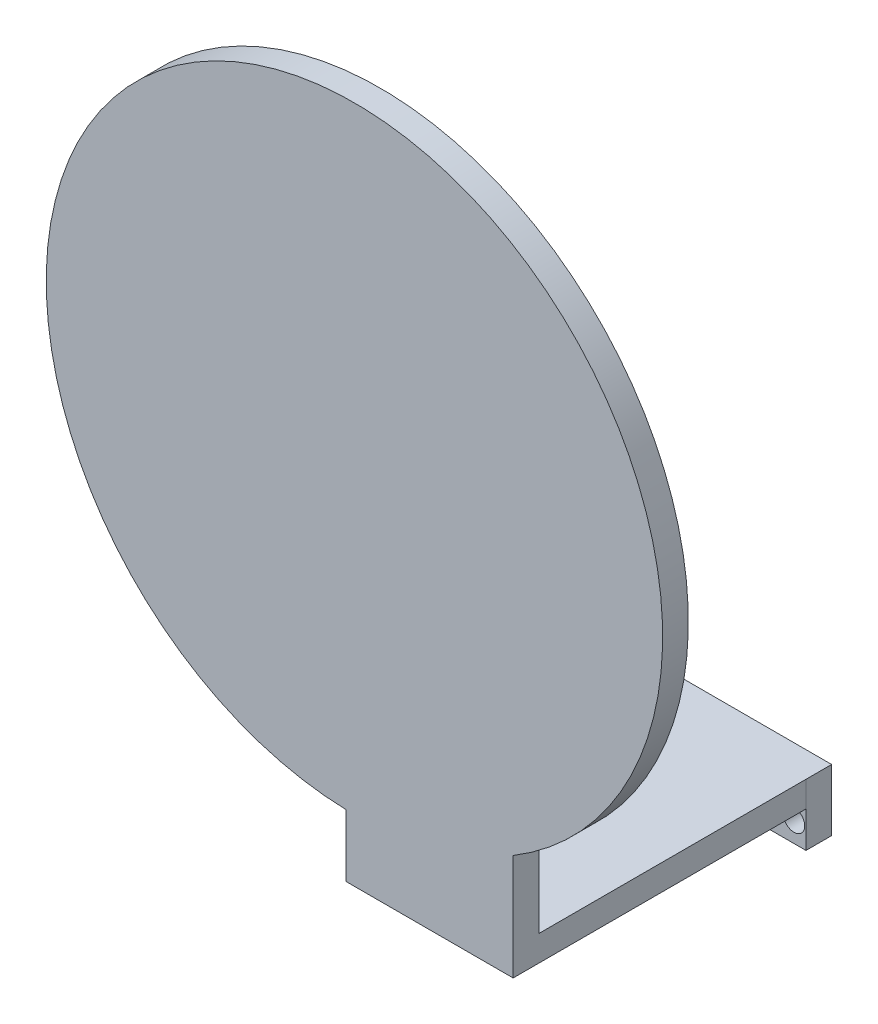
ISO-10303-21;
HEADER;
FILE_DESCRIPTION(('STEP AP214'),'2;1');
FILE_NAME('part.step','',(''),(''),'','','');
FILE_SCHEMA(('AUTOMOTIVE_DESIGN { 1 0 10303 214 1 1 1 1 }'));
ENDSEC;
DATA;
#1=APPLICATION_CONTEXT('core data for automotive mechanical design processes');
#2=APPLICATION_PROTOCOL_DEFINITION('international standard','automotive_design',2000,#1);
#3=PRODUCT_CONTEXT('',#1,'mechanical');
#4=PRODUCT('Part','Part','',(#3));
#5=PRODUCT_RELATED_PRODUCT_CATEGORY('part','',(#4));
#6=PRODUCT_DEFINITION_FORMATION('','',#4);
#7=PRODUCT_DEFINITION_CONTEXT('part definition',#1,'design');
#8=PRODUCT_DEFINITION('design','',#6,#7);
#9=PRODUCT_DEFINITION_SHAPE('','',#8);
#10=(LENGTH_UNIT() NAMED_UNIT(*) SI_UNIT(.MILLI.,.METRE.));
#11=(NAMED_UNIT(*) PLANE_ANGLE_UNIT() SI_UNIT($,.RADIAN.));
#12=(NAMED_UNIT(*) SI_UNIT($,.STERADIAN.) SOLID_ANGLE_UNIT());
#13=UNCERTAINTY_MEASURE_WITH_UNIT(LENGTH_MEASURE(1.E-05),#10,'distance_accuracy_value','');
#14=(GEOMETRIC_REPRESENTATION_CONTEXT(3) GLOBAL_UNCERTAINTY_ASSIGNED_CONTEXT((#13)) GLOBAL_UNIT_ASSIGNED_CONTEXT((#10,
#11,#12)) REPRESENTATION_CONTEXT('',''));
#15=CARTESIAN_POINT('',(0.,0.,0.));
#16=DIRECTION('',(0.,0.,1.));
#17=DIRECTION('',(1.,0.,0.));
#18=AXIS2_PLACEMENT_3D('',#15,#16,#17);
#19=CARTESIAN_POINT('',(0.,0.,-25136.0647404449));
#20=DIRECTION('',(0.,0.,1.));
#21=DIRECTION('',(1.,0.,0.));
#22=AXIS2_PLACEMENT_3D('',#19,#20,#21);
#23=PLANE('',#22);
#24=DIRECTION('',(0.,1.,0.));
#25=VECTOR('',#24,1.);
#26=CARTESIAN_POINT('',(376.838624880836,-3588.06569555698,-25136.0647404449));
#27=LINE('',#26,#25);
#28=CARTESIAN_POINT('',(376.838624880836,-3593.06569555698,-25136.0647404449));
#29=VERTEX_POINT('',#28);
#30=CARTESIAN_POINT('',(376.838624880836,-3588.06569555698,-25136.0647404449));
#31=VERTEX_POINT('',#30);
#32=EDGE_CURVE('E132',#29,#31,#27,.T.);
#33=ORIENTED_EDGE('',*,*,#32,.F.);
#34=DIRECTION('',(1.,0.,0.));
#35=VECTOR('',#34,1.);
#36=CARTESIAN_POINT('',(376.838624880836,-3593.06569555698,-25136.0647404449));
#37=LINE('',#36,#35);
#38=CARTESIAN_POINT('',(344.298878818983,-3593.06569555698,-25136.0647404449));
#39=VERTEX_POINT('',#38);
#40=EDGE_CURVE('E135',#39,#29,#37,.T.);
#41=ORIENTED_EDGE('',*,*,#40,.F.);
#42=DIRECTION('',(0.,-1.,0.));
#43=VECTOR('',#42,1.);
#44=CARTESIAN_POINT('',(344.298878818983,-3592.06569555698,-25136.0647404449));
#45=LINE('',#44,#43);
#46=CARTESIAN_POINT('',(344.298878818983,-3600.06569555698,-25136.0647404449));
#47=VERTEX_POINT('',#46);
#48=EDGE_CURVE('E168',#39,#47,#45,.T.);
#49=ORIENTED_EDGE('',*,*,#48,.T.);
#50=DIRECTION('',(1.,0.,0.));
#51=VECTOR('',#50,1.);
#52=CARTESIAN_POINT('',(344.298878818983,-3600.06569555698,-25136.0647404449));
#53=LINE('',#52,#51);
#54=CARTESIAN_POINT('',(376.838878818983,-3600.06569555698,-25136.0647404449));
#55=VERTEX_POINT('',#54);
#56=EDGE_CURVE('E170',#47,#55,#53,.T.);
#57=ORIENTED_EDGE('',*,*,#56,.T.);
#58=DIRECTION('',(0.,1.,0.));
#59=VECTOR('',#58,1.);
#60=CARTESIAN_POINT('',(376.838878818983,-3592.06569555698,-25136.0647404449));
#61=LINE('',#60,#59);
#62=CARTESIAN_POINT('',(376.838878818983,-3588.06569555698,-25136.0647404449));
#63=VERTEX_POINT('',#62);
#64=EDGE_CURVE('E173',#55,#63,#61,.T.);
#65=ORIENTED_EDGE('',*,*,#64,.T.);
#66=DIRECTION('',(1.,0.,0.));
#67=VECTOR('',#66,1.);
#68=CARTESIAN_POINT('',(376.838878818983,-3588.06569555698,-25136.0647404449));
#69=LINE('',#68,#67);
#70=EDGE_CURVE('E124',#31,#63,#69,.T.);
#71=ORIENTED_EDGE('',*,*,#70,.F.);
#72=EDGE_LOOP('',(#33,#41,#49,#57,#65,#71));
#73=FACE_BOUND('',#72,.T.);
#74=CARTESIAN_POINT('',(374.501060255471,-3596.0607896217,-25136.0647404449));
#75=DIRECTION('',(0.,0.,1.));
#76=DIRECTION('',(1.,0.,0.));
#77=AXIS2_PLACEMENT_3D('',#74,#75,#76);
#78=CIRCLE('',#77,2.10000000001567);
#79=CARTESIAN_POINT('',(376.601060255487,-3596.0607896217,-25136.0647404449));
#80=VERTEX_POINT('',#79);
#81=EDGE_CURVE('E162',#80,#80,#78,.T.);
#82=ORIENTED_EDGE('',*,*,#81,.F.);
#83=EDGE_LOOP('',(#82));
#84=FACE_BOUND('',#83,.T.);
#85=CARTESIAN_POINT('',(358.013502111512,-3596.0607896217,-25136.0647404449));
#86=DIRECTION('',(0.,0.,1.));
#87=DIRECTION('',(1.,0.,0.));
#88=AXIS2_PLACEMENT_3D('',#85,#86,#87);
#89=CIRCLE('',#88,2.10000000001562);
#90=CARTESIAN_POINT('',(360.113502111528,-3596.0607896217,-25136.0647404449));
#91=VERTEX_POINT('',#90);
#92=EDGE_CURVE('E156',#91,#91,#89,.T.);
#93=ORIENTED_EDGE('',*,*,#92,.F.);
#94=EDGE_LOOP('',(#93));
#95=FACE_BOUND('',#94,.T.);
#96=ADVANCED_FACE('F33',(#73,#84,#95),#23,.T.);
#97=CARTESIAN_POINT('',(0.,0.,-25141.0647404449));
#98=DIRECTION('',(0.,0.,1.));
#99=DIRECTION('',(1.,0.,0.));
#100=AXIS2_PLACEMENT_3D('',#97,#98,#99);
#101=PLANE('',#100);
#102=DIRECTION('',(0.,-1.,0.));
#103=VECTOR('',#102,1.);
#104=CARTESIAN_POINT('',(344.298878818983,-3592.06569555698,-25141.0647404449));
#105=LINE('',#104,#103);
#106=CARTESIAN_POINT('',(344.298878818983,-3588.06569555698,-25141.0647404449));
#107=VERTEX_POINT('',#106);
#108=CARTESIAN_POINT('',(344.298878818983,-3600.06569555698,-25141.0647404449));
#109=VERTEX_POINT('',#108);
#110=EDGE_CURVE('E165',#107,#109,#105,.T.);
#111=ORIENTED_EDGE('',*,*,#110,.F.);
#112=DIRECTION('',(-1.,0.,0.));
#113=VECTOR('',#112,1.);
#114=CARTESIAN_POINT('',(376.838878818983,-3588.06569555698,-25141.0647404449));
#115=LINE('',#114,#113);
#116=CARTESIAN_POINT('',(376.838878818983,-3588.06569555698,-25141.0647404449));
#117=VERTEX_POINT('',#116);
#118=EDGE_CURVE('E123',#117,#107,#115,.T.);
#119=ORIENTED_EDGE('',*,*,#118,.F.);
#120=DIRECTION('',(0.,1.,0.));
#121=VECTOR('',#120,1.);
#122=CARTESIAN_POINT('',(376.838878818983,-3592.06569555698,-25141.0647404449));
#123=LINE('',#122,#121);
#124=CARTESIAN_POINT('',(376.838878818983,-3600.06569555698,-25141.0647404449));
#125=VERTEX_POINT('',#124);
#126=EDGE_CURVE('E171',#125,#117,#123,.T.);
#127=ORIENTED_EDGE('',*,*,#126,.F.);
#128=DIRECTION('',(1.,0.,0.));
#129=VECTOR('',#128,1.);
#130=CARTESIAN_POINT('',(344.298878818983,-3600.06569555698,-25141.0647404449));
#131=LINE('',#130,#129);
#132=EDGE_CURVE('E177',#109,#125,#131,.T.);
#133=ORIENTED_EDGE('',*,*,#132,.F.);
#134=EDGE_LOOP('',(#111,#119,#127,#133));
#135=FACE_BOUND('',#134,.T.);
#136=CARTESIAN_POINT('',(374.501060255471,-3596.0607896217,-25141.0647404449));
#137=DIRECTION('',(0.,0.,1.));
#138=DIRECTION('',(1.,0.,0.));
#139=AXIS2_PLACEMENT_3D('',#136,#137,#138);
#140=CIRCLE('',#139,2.10000000001567);
#141=CARTESIAN_POINT('',(376.601060255487,-3596.0607896217,-25141.0647404449));
#142=VERTEX_POINT('',#141);
#143=EDGE_CURVE('E159',#142,#142,#140,.T.);
#144=ORIENTED_EDGE('',*,*,#143,.T.);
#145=EDGE_LOOP('',(#144));
#146=FACE_BOUND('',#145,.T.);
#147=CARTESIAN_POINT('',(358.013502111512,-3596.0607896217,-25141.0647404449));
#148=DIRECTION('',(0.,0.,1.));
#149=DIRECTION('',(1.,0.,0.));
#150=AXIS2_PLACEMENT_3D('',#147,#148,#149);
#151=CIRCLE('',#150,2.10000000001562);
#152=CARTESIAN_POINT('',(360.113502111528,-3596.0607896217,-25141.0647404449));
#153=VERTEX_POINT('',#152);
#154=EDGE_CURVE('E155',#153,#153,#151,.T.);
#155=ORIENTED_EDGE('',*,*,#154,.T.);
#156=EDGE_LOOP('',(#155));
#157=FACE_BOUND('',#156,.T.);
#158=ADVANCED_FACE('F189',(#135,#146,#157),#101,.F.);
#159=CARTESIAN_POINT('',(344.298878818983,-3592.06569555698,-25136.0647404449));
#160=DIRECTION('',(1.,0.,0.));
#161=DIRECTION('',(0.,0.,-1.));
#162=AXIS2_PLACEMENT_3D('',#159,#160,#161);
#163=PLANE('',#162);
#164=DIRECTION('',(0.,-1.,0.));
#165=VECTOR('',#164,1.);
#166=CARTESIAN_POINT('',(344.298878818984,-3588.06569555698,-25079.0647404449));
#167=LINE('',#166,#165);
#168=CARTESIAN_POINT('',(344.298878818984,-3580.94955599656,-25079.0647404449));
#169=VERTEX_POINT('',#168);
#170=CARTESIAN_POINT('',(344.298878818984,-3593.06569555698,-25079.0647404449));
#171=VERTEX_POINT('',#170);
#172=EDGE_CURVE('E48',#169,#171,#167,.T.);
#173=ORIENTED_EDGE('',*,*,#172,.F.);
#174=DIRECTION('',(0.,0.,1.));
#175=VECTOR('',#174,1.);
#176=CARTESIAN_POINT('',(344.298878818983,-3580.94955599656,-25084.0647404449));
#177=LINE('',#176,#175);
#178=CARTESIAN_POINT('',(344.298878818984,-3580.94955599656,-25084.0647404449));
#179=VERTEX_POINT('',#178);
#180=EDGE_CURVE('E108',#169,#179,#177,.F.);
#181=ORIENTED_EDGE('',*,*,#180,.T.);
#182=DIRECTION('',(0.,-1.,0.));
#183=VECTOR('',#182,1.);
#184=CARTESIAN_POINT('',(344.298878818984,-3560.56569555698,-25084.0647404449));
#185=LINE('',#184,#183);
#186=CARTESIAN_POINT('',(344.298878818984,-3588.06569555698,-25084.0647404449));
#187=VERTEX_POINT('',#186);
#188=EDGE_CURVE('E104',#179,#187,#185,.T.);
#189=ORIENTED_EDGE('',*,*,#188,.T.);
#190=DIRECTION('',(0.,0.,1.));
#191=VECTOR('',#190,1.);
#192=CARTESIAN_POINT('',(344.298878818983,-3588.06569555698,-25136.0647404449));
#193=LINE('',#192,#191);
#194=EDGE_CURVE('E107',#107,#187,#193,.T.);
#195=ORIENTED_EDGE('',*,*,#194,.F.);
#196=ORIENTED_EDGE('',*,*,#110,.T.);
#197=DIRECTION('',(0.,0.,-1.));
#198=VECTOR('',#197,1.);
#199=CARTESIAN_POINT('',(344.298878818983,-3600.06569555698,-25136.0647404449));
#200=LINE('',#199,#198);
#201=EDGE_CURVE('E11',#47,#109,#200,.T.);
#202=ORIENTED_EDGE('',*,*,#201,.F.);
#203=ORIENTED_EDGE('',*,*,#48,.F.);
#204=DIRECTION('',(0.,0.,-1.));
#205=VECTOR('',#204,1.);
#206=CARTESIAN_POINT('',(344.298878818984,-3593.06569555698,-25079.0647404449));
#207=LINE('',#206,#205);
#208=EDGE_CURVE('E146',#171,#39,#207,.T.);
#209=ORIENTED_EDGE('',*,*,#208,.F.);
#210=EDGE_LOOP('',(#173,#181,#189,#195,#196,#202,#203,#209));
#211=FACE_BOUND('',#210,.T.);
#212=ADVANCED_FACE('F35',(#211),#163,.F.);
#213=CARTESIAN_POINT('',(344.298878818983,-3600.06569555698,-25136.0647404449));
#214=DIRECTION('',(0.,1.,0.));
#215=DIRECTION('',(0.,0.,1.));
#216=AXIS2_PLACEMENT_3D('',#213,#214,#215);
#217=PLANE('',#216);
#218=ORIENTED_EDGE('',*,*,#132,.T.);
#219=DIRECTION('',(0.,0.,-1.));
#220=VECTOR('',#219,1.);
#221=CARTESIAN_POINT('',(376.838878818983,-3600.06569555698,-25136.0647404449));
#222=LINE('',#221,#220);
#223=EDGE_CURVE('E41',#55,#125,#222,.T.);
#224=ORIENTED_EDGE('',*,*,#223,.F.);
#225=ORIENTED_EDGE('',*,*,#56,.F.);
#226=ORIENTED_EDGE('',*,*,#201,.T.);
#227=EDGE_LOOP('',(#218,#224,#225,#226));
#228=FACE_BOUND('',#227,.T.);
#229=ADVANCED_FACE('F196',(#228),#217,.F.);
#230=CARTESIAN_POINT('',(376.838878818983,-3592.06569555698,-25136.0647404449));
#231=DIRECTION('',(-1.,0.,0.));
#232=DIRECTION('',(0.,0.,1.));
#233=AXIS2_PLACEMENT_3D('',#230,#231,#232);
#234=PLANE('',#233);
#235=ORIENTED_EDGE('',*,*,#126,.T.);
#236=DIRECTION('',(0.,0.,-1.));
#237=VECTOR('',#236,1.);
#238=CARTESIAN_POINT('',(376.838878818983,-3588.06569555698,-25136.0647404449));
#239=LINE('',#238,#237);
#240=EDGE_CURVE('E151',#63,#117,#239,.T.);
#241=ORIENTED_EDGE('',*,*,#240,.F.);
#242=ORIENTED_EDGE('',*,*,#64,.F.);
#243=ORIENTED_EDGE('',*,*,#223,.T.);
#244=EDGE_LOOP('',(#235,#241,#242,#243));
#245=FACE_BOUND('',#244,.T.);
#246=ADVANCED_FACE('F184',(#245),#234,.F.);
#247=CARTESIAN_POINT('',(374.501060255471,-3596.0607896217,-25136.0647404449));
#248=DIRECTION('',(0.,0.,-1.));
#249=DIRECTION('',(-1.,0.,0.));
#250=AXIS2_PLACEMENT_3D('',#247,#248,#249);
#251=CYLINDRICAL_SURFACE('',#250,2.10000000001567);
#252=ORIENTED_EDGE('',*,*,#81,.T.);
#253=EDGE_LOOP('',(#252));
#254=FACE_BOUND('',#253,.T.);
#255=ORIENTED_EDGE('',*,*,#143,.F.);
#256=EDGE_LOOP('',(#255));
#257=FACE_BOUND('',#256,.T.);
#258=ADVANCED_FACE('F224',(#254,#257),#251,.F.);
#259=CARTESIAN_POINT('',(358.013502111512,-3596.0607896217,-25136.0647404449));
#260=DIRECTION('',(0.,0.,-1.));
#261=DIRECTION('',(-1.,0.,0.));
#262=AXIS2_PLACEMENT_3D('',#259,#260,#261);
#263=CYLINDRICAL_SURFACE('',#262,2.10000000001562);
#264=ORIENTED_EDGE('',*,*,#92,.T.);
#265=EDGE_LOOP('',(#264));
#266=FACE_BOUND('',#265,.T.);
#267=ORIENTED_EDGE('',*,*,#154,.F.);
#268=EDGE_LOOP('',(#267));
#269=FACE_BOUND('',#268,.T.);
#270=ADVANCED_FACE('F249',(#266,#269),#263,.F.);
#271=CARTESIAN_POINT('',(0.,-3588.06569555698,0.));
#272=DIRECTION('',(0.,1.,0.));
#273=DIRECTION('',(0.,0.,1.));
#274=AXIS2_PLACEMENT_3D('',#271,#272,#273);
#275=PLANE('',#274);
#276=DIRECTION('',(-1.,0.,0.));
#277=VECTOR('',#276,1.);
#278=CARTESIAN_POINT('',(376.838624880836,-3588.06569555698,-25084.0647404449));
#279=LINE('',#278,#277);
#280=CARTESIAN_POINT('',(376.838624880836,-3588.06569555698,-25084.0647404449));
#281=VERTEX_POINT('',#280);
#282=EDGE_CURVE('E114',#281,#187,#279,.T.);
#283=ORIENTED_EDGE('',*,*,#282,.F.);
#284=DIRECTION('',(0.,0.,-1.));
#285=VECTOR('',#284,1.);
#286=CARTESIAN_POINT('',(376.838624880836,-3588.06569555698,-25079.0647404449));
#287=LINE('',#286,#285);
#288=EDGE_CURVE('E149',#281,#31,#287,.T.);
#289=ORIENTED_EDGE('',*,*,#288,.T.);
#290=ORIENTED_EDGE('',*,*,#70,.T.);
#291=ORIENTED_EDGE('',*,*,#240,.T.);
#292=ORIENTED_EDGE('',*,*,#118,.T.);
#293=ORIENTED_EDGE('',*,*,#194,.T.);
#294=EDGE_LOOP('',(#283,#289,#290,#291,#292,#293));
#295=FACE_BOUND('',#294,.T.);
#296=ADVANCED_FACE('F119',(#295),#275,.T.);
#297=CARTESIAN_POINT('',(376.838624880836,-3588.06569555698,-25079.0647404449));
#298=DIRECTION('',(-1.,0.,0.));
#299=DIRECTION('',(0.,0.,1.));
#300=AXIS2_PLACEMENT_3D('',#297,#298,#299);
#301=PLANE('',#300);
#302=DIRECTION('',(0.,-1.,0.));
#303=VECTOR('',#302,1.);
#304=CARTESIAN_POINT('',(376.838624880836,-3560.56569555698,-25084.0647404449));
#305=LINE('',#304,#303);
#306=CARTESIAN_POINT('',(376.838624880836,-3572.40817978573,-25084.0647404449));
#307=VERTEX_POINT('',#306);
#308=EDGE_CURVE('E113',#307,#281,#305,.T.);
#309=ORIENTED_EDGE('',*,*,#308,.F.);
#310=DIRECTION('',(0.,0.,1.));
#311=VECTOR('',#310,1.);
#312=CARTESIAN_POINT('',(376.838624880836,-3572.40817978573,-25084.0647404449));
#313=LINE('',#312,#311);
#314=CARTESIAN_POINT('',(376.838624880836,-3572.40817978573,-25079.0647404449));
#315=VERTEX_POINT('',#314);
#316=EDGE_CURVE('E56',#307,#315,#313,.T.);
#317=ORIENTED_EDGE('',*,*,#316,.T.);
#318=DIRECTION('',(0.,1.,0.));
#319=VECTOR('',#318,1.);
#320=CARTESIAN_POINT('',(376.838624880836,-3588.06569555698,-25079.0647404449));
#321=LINE('',#320,#319);
#322=CARTESIAN_POINT('',(376.838624880836,-3593.06569555698,-25079.0647404449));
#323=VERTEX_POINT('',#322);
#324=EDGE_CURVE('E133',#323,#315,#321,.T.);
#325=ORIENTED_EDGE('',*,*,#324,.F.);
#326=DIRECTION('',(0.,0.,-1.));
#327=VECTOR('',#326,1.);
#328=CARTESIAN_POINT('',(376.838624880836,-3593.06569555698,-25079.0647404449));
#329=LINE('',#328,#327);
#330=EDGE_CURVE('E139',#323,#29,#329,.T.);
#331=ORIENTED_EDGE('',*,*,#330,.T.);
#332=ORIENTED_EDGE('',*,*,#32,.T.);
#333=ORIENTED_EDGE('',*,*,#288,.F.);
#334=EDGE_LOOP('',(#309,#317,#325,#331,#332,#333));
#335=FACE_BOUND('',#334,.T.);
#336=ADVANCED_FACE('F270',(#335),#301,.F.);
#337=CARTESIAN_POINT('',(376.838624880836,-3593.06569555698,-25079.0647404449));
#338=DIRECTION('',(0.,1.,0.));
#339=DIRECTION('',(0.,0.,1.));
#340=AXIS2_PLACEMENT_3D('',#337,#338,#339);
#341=PLANE('',#340);
#342=ORIENTED_EDGE('',*,*,#40,.T.);
#343=ORIENTED_EDGE('',*,*,#330,.F.);
#344=DIRECTION('',(1.,0.,0.));
#345=VECTOR('',#344,1.);
#346=CARTESIAN_POINT('',(376.838624880836,-3593.06569555698,-25079.0647404449));
#347=LINE('',#346,#345);
#348=EDGE_CURVE('E137',#171,#323,#347,.T.);
#349=ORIENTED_EDGE('',*,*,#348,.F.);
#350=ORIENTED_EDGE('',*,*,#208,.T.);
#351=EDGE_LOOP('',(#342,#343,#349,#350));
#352=FACE_BOUND('',#351,.T.);
#353=ADVANCED_FACE('F199',(#352),#341,.F.);
#354=CARTESIAN_POINT('',(0.,0.,-25079.0647404449));
#355=DIRECTION('',(0.,0.,-1.));
#356=DIRECTION('',(-1.,0.,0.));
#357=AXIS2_PLACEMENT_3D('',#354,#355,#356);
#358=PLANE('',#357);
#359=CARTESIAN_POINT('',(345.94627105013,-3520.97217610348,-25079.0647404449));
#360=DIRECTION('',(0.,0.,1.));
#361=DIRECTION('',(1.,0.,0.));
#362=AXIS2_PLACEMENT_3D('',#359,#360,#361);
#363=CIRCLE('',#362,60.0000000000146);
#364=EDGE_CURVE('E205',#315,#169,#363,.T.);
#365=ORIENTED_EDGE('',*,*,#364,.T.);
#366=ORIENTED_EDGE('',*,*,#172,.T.);
#367=ORIENTED_EDGE('',*,*,#348,.T.);
#368=ORIENTED_EDGE('',*,*,#324,.T.);
#369=EDGE_LOOP('',(#365,#366,#367,#368));
#370=FACE_BOUND('',#369,.T.);
#371=ADVANCED_FACE('F203',(#370),#358,.F.);
#372=CARTESIAN_POINT('',(376.838624880836,-3560.56569555698,-25084.0647404449));
#373=DIRECTION('',(0.,0.,1.));
#374=DIRECTION('',(1.,0.,0.));
#375=AXIS2_PLACEMENT_3D('',#372,#373,#374);
#376=PLANE('',#375);
#377=ORIENTED_EDGE('',*,*,#188,.F.);
#378=CARTESIAN_POINT('',(345.94627105013,-3520.97217610348,-25084.0647404449));
#379=DIRECTION('',(0.,0.,1.));
#380=DIRECTION('',(1.,0.,0.));
#381=AXIS2_PLACEMENT_3D('',#378,#379,#380);
#382=CIRCLE('',#381,60.0000000000146);
#383=EDGE_CURVE('E207',#307,#179,#382,.T.);
#384=ORIENTED_EDGE('',*,*,#383,.F.);
#385=ORIENTED_EDGE('',*,*,#308,.T.);
#386=ORIENTED_EDGE('',*,*,#282,.T.);
#387=EDGE_LOOP('',(#377,#384,#385,#386));
#388=FACE_BOUND('',#387,.T.);
#389=ADVANCED_FACE('F126',(#388),#376,.F.);
#390=CARTESIAN_POINT('',(345.94627105013,-3520.97217610348,-25084.0647404449));
#391=DIRECTION('',(0.,0.,1.));
#392=DIRECTION('',(1.,0.,0.));
#393=AXIS2_PLACEMENT_3D('',#390,#391,#392);
#394=CYLINDRICAL_SURFACE('',#393,60.0000000000146);
#395=ORIENTED_EDGE('',*,*,#180,.F.);
#396=ORIENTED_EDGE('',*,*,#364,.F.);
#397=ORIENTED_EDGE('',*,*,#316,.F.);
#398=ORIENTED_EDGE('',*,*,#383,.T.);
#399=EDGE_LOOP('',(#395,#396,#397,#398));
#400=FACE_BOUND('',#399,.T.);
#401=ADVANCED_FACE('F210',(#400),#394,.T.);
#402=CLOSED_SHELL('',(#96,#158,#212,#229,#246,#258,#270,#296,#336,#353,#371,#389,#401));
#403=MANIFOLD_SOLID_BREP('B2',#402);
#404=ADVANCED_BREP_SHAPE_REPRESENTATION('',(#18,#403),#14);
#405=SHAPE_DEFINITION_REPRESENTATION(#9,#404);
ENDSEC;
END-ISO-10303-21;
